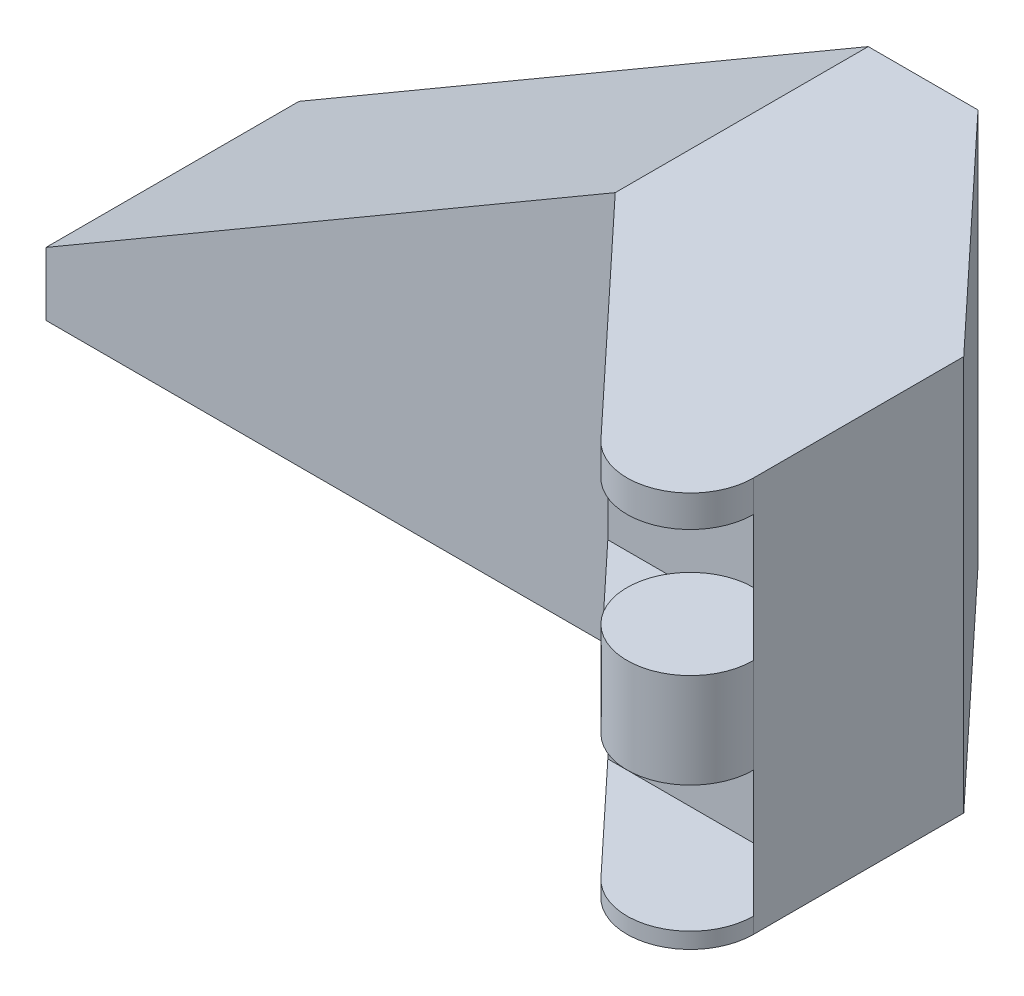
ISO-10303-21;
HEADER;
FILE_DESCRIPTION(('STEP AP214'),'2;1');
FILE_NAME('part.step','',(''),(''),'','','');
FILE_SCHEMA(('AUTOMOTIVE_DESIGN { 1 0 10303 214 1 1 1 1 }'));
ENDSEC;
DATA;
#1=APPLICATION_CONTEXT('core data for automotive mechanical design processes');
#2=APPLICATION_PROTOCOL_DEFINITION('international standard','automotive_design',2000,#1);
#3=PRODUCT_CONTEXT('',#1,'mechanical');
#4=PRODUCT('Part','Part','',(#3));
#5=PRODUCT_RELATED_PRODUCT_CATEGORY('part','',(#4));
#6=PRODUCT_DEFINITION_FORMATION('','',#4);
#7=PRODUCT_DEFINITION_CONTEXT('part definition',#1,'design');
#8=PRODUCT_DEFINITION('design','',#6,#7);
#9=PRODUCT_DEFINITION_SHAPE('','',#8);
#10=(LENGTH_UNIT() NAMED_UNIT(*) SI_UNIT(.MILLI.,.METRE.));
#11=(NAMED_UNIT(*) PLANE_ANGLE_UNIT() SI_UNIT($,.RADIAN.));
#12=(NAMED_UNIT(*) SI_UNIT($,.STERADIAN.) SOLID_ANGLE_UNIT());
#13=UNCERTAINTY_MEASURE_WITH_UNIT(LENGTH_MEASURE(1.E-05),#10,'distance_accuracy_value','');
#14=(GEOMETRIC_REPRESENTATION_CONTEXT(3) GLOBAL_UNCERTAINTY_ASSIGNED_CONTEXT((#13)) GLOBAL_UNIT_ASSIGNED_CONTEXT((#10,
#11,#12)) REPRESENTATION_CONTEXT('',''));
#15=CARTESIAN_POINT('',(0.,0.,0.));
#16=DIRECTION('',(0.,0.,1.));
#17=DIRECTION('',(1.,0.,0.));
#18=AXIS2_PLACEMENT_3D('',#15,#16,#17);
#19=CARTESIAN_POINT('',(8.06251028519232,39.6875,22.1971381499487));
#20=DIRECTION('',(0.730313340914596,0.,-0.683112307078537));
#21=DIRECTION('',(-0.683112307078537,0.,-0.730313340914596));
#22=AXIS2_PLACEMENT_3D('',#19,#20,#21);
#23=PLANE('',#22);
#24=DIRECTION('',(0.,1.,0.));
#25=VECTOR('',#24,1.);
#26=CARTESIAN_POINT('',(-1.93448981578791,1.5875,11.509375));
#27=LINE('',#26,#25);
#28=CARTESIAN_POINT('',(-1.93448981578791,1.5875,11.509375));
#29=VERTEX_POINT('',#28);
#30=CARTESIAN_POINT('',(-1.93448981578791,17.4625,11.509375));
#31=VERTEX_POINT('',#30);
#32=EDGE_CURVE('E270',#29,#31,#27,.T.);
#33=ORIENTED_EDGE('',*,*,#32,.T.);
#34=DIRECTION('',(0.683112307078537,0.,0.730313340914596));
#35=VECTOR('',#34,1.);
#36=CARTESIAN_POINT('',(8.06251028519232,17.4625,22.1971381499487));
#37=LINE('',#36,#35);
#38=CARTESIAN_POINT('',(8.06251028519232,17.4625,22.1971381499487));
#39=VERTEX_POINT('',#38);
#40=EDGE_CURVE('E363',#31,#39,#37,.T.);
#41=ORIENTED_EDGE('',*,*,#40,.T.);
#42=DIRECTION('',(0.,-1.,0.));
#43=VECTOR('',#42,1.);
#44=CARTESIAN_POINT('',(8.06251028519232,39.6875,22.1971381499487));
#45=LINE('',#44,#43);
#46=CARTESIAN_POINT('',(8.06251028519232,20.6375,22.1971381499487));
#47=VERTEX_POINT('',#46);
#48=EDGE_CURVE('E210',#47,#39,#45,.T.);
#49=ORIENTED_EDGE('',*,*,#48,.F.);
#50=DIRECTION('',(0.683112307078537,0.,0.730313340914596));
#51=VECTOR('',#50,1.);
#52=CARTESIAN_POINT('',(-1.93448981578791,20.6375,11.509375));
#53=LINE('',#52,#51);
#54=CARTESIAN_POINT('',(-1.93448981578791,20.6375,11.509375));
#55=VERTEX_POINT('',#54);
#56=EDGE_CURVE('E321',#55,#47,#53,.T.);
#57=ORIENTED_EDGE('',*,*,#56,.F.);
#58=DIRECTION('',(0.,1.,0.));
#59=VECTOR('',#58,1.);
#60=CARTESIAN_POINT('',(-1.93448981578791,23.8125,11.509375));
#61=LINE('',#60,#59);
#62=CARTESIAN_POINT('',(-1.93448981578791,36.5125,11.509375));
#63=VERTEX_POINT('',#62);
#64=EDGE_CURVE('E181',#55,#63,#61,.T.);
#65=ORIENTED_EDGE('',*,*,#64,.T.);
#66=DIRECTION('',(0.683112307078537,0.,0.730313340914596));
#67=VECTOR('',#66,1.);
#68=CARTESIAN_POINT('',(-1.93448981578791,36.5125,11.509375));
#69=LINE('',#68,#67);
#70=CARTESIAN_POINT('',(8.06251028519232,36.5125,22.1971381499487));
#71=VERTEX_POINT('',#70);
#72=EDGE_CURVE('E278',#63,#71,#69,.T.);
#73=ORIENTED_EDGE('',*,*,#72,.T.);
#74=CARTESIAN_POINT('',(8.06251028519232,39.6875,22.1971381499487));
#75=VERTEX_POINT('',#74);
#76=EDGE_CURVE('E206',#75,#71,#45,.T.);
#77=ORIENTED_EDGE('',*,*,#76,.F.);
#78=DIRECTION('',(0.683112307078537,0.,0.730313340914596));
#79=VECTOR('',#78,1.);
#80=CARTESIAN_POINT('',(8.06251028519232,39.6875,22.1971381499487));
#81=LINE('',#80,#79);
#82=CARTESIAN_POINT('',(-12.7,39.6875,0.));
#83=VERTEX_POINT('',#82);
#84=EDGE_CURVE('E194',#83,#75,#81,.T.);
#85=ORIENTED_EDGE('',*,*,#84,.F.);
#86=DIRECTION('',(0.,-1.,0.));
#87=VECTOR('',#86,1.);
#88=CARTESIAN_POINT('',(-12.7,39.6875,0.));
#89=LINE('',#88,#87);
#90=CARTESIAN_POINT('',(-12.7,0.,0.));
#91=VERTEX_POINT('',#90);
#92=EDGE_CURVE('E209',#83,#91,#89,.T.);
#93=ORIENTED_EDGE('',*,*,#92,.T.);
#94=DIRECTION('',(0.683112307078537,0.,0.730313340914596));
#95=VECTOR('',#94,1.);
#96=CARTESIAN_POINT('',(8.06251028519232,0.,22.1971381499487));
#97=LINE('',#96,#95);
#98=CARTESIAN_POINT('',(8.06251028519232,0.,22.1971381499487));
#99=VERTEX_POINT('',#98);
#100=EDGE_CURVE('E183',#91,#99,#97,.T.);
#101=ORIENTED_EDGE('',*,*,#100,.T.);
#102=CARTESIAN_POINT('',(8.06251028519232,1.5875,22.1971381499487));
#103=VERTEX_POINT('',#102);
#104=EDGE_CURVE('E204',#103,#99,#45,.T.);
#105=ORIENTED_EDGE('',*,*,#104,.F.);
#106=DIRECTION('',(0.683112307078537,0.,0.730313340914596));
#107=VECTOR('',#106,1.);
#108=CARTESIAN_POINT('',(-1.93448981578791,1.5875,11.509375));
#109=LINE('',#108,#107);
#110=EDGE_CURVE('E335',#29,#103,#109,.T.);
#111=ORIENTED_EDGE('',*,*,#110,.F.);
#112=EDGE_LOOP('',(#33,#41,#49,#57,#65,#73,#77,#85,#93,#101,#105,#111));
#113=FACE_BOUND('',#112,.T.);
#114=ADVANCED_FACE('F33',(#113),#23,.F.);
#115=CARTESIAN_POINT('',(12.7,39.6875,17.859375));
#116=DIRECTION('',(0.,-1.,0.));
#117=DIRECTION('',(0.,0.,-1.));
#118=AXIS2_PLACEMENT_3D('',#115,#116,#117);
#119=CYLINDRICAL_SURFACE('',#118,6.35);
#120=CARTESIAN_POINT('',(12.7,1.5875,17.859375));
#121=DIRECTION('',(0.,1.,0.));
#122=DIRECTION('',(0.,0.,1.));
#123=AXIS2_PLACEMENT_3D('',#120,#121,#122);
#124=CIRCLE('',#123,6.35);
#125=CARTESIAN_POINT('',(19.05,1.58750000000002,17.859375));
#126=VERTEX_POINT('',#125);
#127=EDGE_CURVE('E48',#103,#126,#124,.T.);
#128=ORIENTED_EDGE('',*,*,#127,.F.);
#129=ORIENTED_EDGE('',*,*,#104,.T.);
#130=CARTESIAN_POINT('',(12.7,0.,17.859375));
#131=DIRECTION('',(0.,1.,0.));
#132=DIRECTION('',(0.,0.,1.));
#133=AXIS2_PLACEMENT_3D('',#130,#131,#132);
#134=CIRCLE('',#133,6.35);
#135=CARTESIAN_POINT('',(19.05,0.,17.859375));
#136=VERTEX_POINT('',#135);
#137=EDGE_CURVE('E186',#99,#136,#134,.T.);
#138=ORIENTED_EDGE('',*,*,#137,.T.);
#139=DIRECTION('',(0.,-1.,0.));
#140=VECTOR('',#139,1.);
#141=CARTESIAN_POINT('',(19.05,39.6875,17.859375));
#142=LINE('',#141,#140);
#143=EDGE_CURVE('E200',#126,#136,#142,.T.);
#144=ORIENTED_EDGE('',*,*,#143,.F.);
#145=EDGE_LOOP('',(#128,#129,#138,#144));
#146=FACE_BOUND('',#145,.T.);
#147=ADVANCED_FACE('F236',(#146),#119,.T.);
#148=CARTESIAN_POINT('',(12.7,23.8125,17.859375));
#149=DIRECTION('',(0.,1.,0.));
#150=DIRECTION('',(0.,0.,1.));
#151=AXIS2_PLACEMENT_3D('',#148,#149,#150);
#152=CIRCLE('',#151,6.35);
#153=CARTESIAN_POINT('',(12.7,23.8125,11.509375));
#154=VERTEX_POINT('',#153);
#155=CARTESIAN_POINT('',(19.05,23.8125,17.859375));
#156=VERTEX_POINT('',#155);
#157=EDGE_CURVE('E55',#154,#156,#152,.T.);
#158=ORIENTED_EDGE('',*,*,#157,.F.);
#159=DIRECTION('',(0.,1.,0.));
#160=VECTOR('',#159,1.);
#161=CARTESIAN_POINT('',(12.7,20.6375,11.509375));
#162=LINE('',#161,#160);
#163=CARTESIAN_POINT('',(12.7,20.6375,11.509375));
#164=VERTEX_POINT('',#163);
#165=EDGE_CURVE('E314',#164,#154,#162,.T.);
#166=ORIENTED_EDGE('',*,*,#165,.F.);
#167=CARTESIAN_POINT('',(12.7,20.6375,17.859375));
#168=DIRECTION('',(0.,-1.,0.));
#169=DIRECTION('',(0.,0.,1.));
#170=AXIS2_PLACEMENT_3D('',#167,#168,#169);
#171=CIRCLE('',#170,6.35);
#172=EDGE_CURVE('E352',#47,#164,#171,.T.);
#173=ORIENTED_EDGE('',*,*,#172,.F.);
#174=ORIENTED_EDGE('',*,*,#48,.T.);
#175=CARTESIAN_POINT('',(12.7,17.4625,17.859375));
#176=DIRECTION('',(0.,1.,0.));
#177=DIRECTION('',(0.,0.,1.));
#178=AXIS2_PLACEMENT_3D('',#175,#176,#177);
#179=CIRCLE('',#178,6.35);
#180=CARTESIAN_POINT('',(12.7,17.4625,11.509375));
#181=VERTEX_POINT('',#180);
#182=EDGE_CURVE('E351',#181,#39,#179,.T.);
#183=ORIENTED_EDGE('',*,*,#182,.F.);
#184=DIRECTION('',(0.,-1.,0.));
#185=VECTOR('',#184,1.);
#186=CARTESIAN_POINT('',(12.7,17.4625,11.509375));
#187=LINE('',#186,#185);
#188=CARTESIAN_POINT('',(12.7,14.2875,11.509375));
#189=VERTEX_POINT('',#188);
#190=EDGE_CURVE('E343',#181,#189,#187,.T.);
#191=ORIENTED_EDGE('',*,*,#190,.T.);
#192=CARTESIAN_POINT('',(12.7,14.2875,17.859375));
#193=DIRECTION('',(0.,1.,0.));
#194=DIRECTION('',(0.,0.,1.));
#195=AXIS2_PLACEMENT_3D('',#192,#193,#194);
#196=CIRCLE('',#195,6.35);
#197=CARTESIAN_POINT('',(19.05,14.2875,17.859375));
#198=VERTEX_POINT('',#197);
#199=EDGE_CURVE('E324',#189,#198,#196,.T.);
#200=ORIENTED_EDGE('',*,*,#199,.T.);
#201=EDGE_CURVE('E257',#156,#198,#142,.T.);
#202=ORIENTED_EDGE('',*,*,#201,.F.);
#203=EDGE_LOOP('',(#158,#166,#173,#174,#183,#191,#200,#202));
#204=FACE_BOUND('',#203,.T.);
#205=ADVANCED_FACE('F300',(#204),#119,.T.);
#206=CARTESIAN_POINT('',(-69.85,39.6875,0.));
#207=DIRECTION('',(1.,0.,0.));
#208=DIRECTION('',(0.,0.,-1.));
#209=AXIS2_PLACEMENT_3D('',#206,#207,#208);
#210=PLANE('',#209);
#211=DIRECTION('',(0.,-1.,0.));
#212=VECTOR('',#211,1.);
#213=CARTESIAN_POINT('',(-69.85,39.6875,0.));
#214=LINE('',#213,#212);
#215=CARTESIAN_POINT('',(-69.85,6.35,0.));
#216=VERTEX_POINT('',#215);
#217=CARTESIAN_POINT('',(-69.85,0.,0.));
#218=VERTEX_POINT('',#217);
#219=EDGE_CURVE('E41',#216,#218,#214,.T.);
#220=ORIENTED_EDGE('',*,*,#219,.F.);
#221=DIRECTION('',(0.,0.,-1.));
#222=VECTOR('',#221,1.);
#223=CARTESIAN_POINT('',(-69.85,6.35,24.209375));
#224=LINE('',#223,#222);
#225=CARTESIAN_POINT('',(-69.85,6.35,-25.4));
#226=VERTEX_POINT('',#225);
#227=EDGE_CURVE('E164',#216,#226,#224,.T.);
#228=ORIENTED_EDGE('',*,*,#227,.T.);
#229=DIRECTION('',(0.,-1.,0.));
#230=VECTOR('',#229,1.);
#231=CARTESIAN_POINT('',(-69.85,39.6875,-25.4));
#232=LINE('',#231,#230);
#233=CARTESIAN_POINT('',(-69.85,0.,-25.4));
#234=VERTEX_POINT('',#233);
#235=EDGE_CURVE('E163',#226,#234,#232,.T.);
#236=ORIENTED_EDGE('',*,*,#235,.T.);
#237=DIRECTION('',(0.,0.,1.));
#238=VECTOR('',#237,1.);
#239=CARTESIAN_POINT('',(-69.85,0.,0.));
#240=LINE('',#239,#238);
#241=EDGE_CURVE('E177',#234,#218,#240,.T.);
#242=ORIENTED_EDGE('',*,*,#241,.T.);
#243=EDGE_LOOP('',(#220,#228,#236,#242));
#244=FACE_BOUND('',#243,.T.);
#245=ADVANCED_FACE('F35',(#244),#210,.F.);
#246=CARTESIAN_POINT('',(-12.7,39.6875,0.));
#247=DIRECTION('',(0.,0.,-1.));
#248=DIRECTION('',(-1.,0.,0.));
#249=AXIS2_PLACEMENT_3D('',#246,#247,#248);
#250=PLANE('',#249);
#251=ORIENTED_EDGE('',*,*,#92,.F.);
#252=DIRECTION('',(-0.863778900898434,-0.503871025524086,0.));
#253=VECTOR('',#252,1.);
#254=CARTESIAN_POINT('',(-12.7,39.6875,0.));
#255=LINE('',#254,#253);
#256=EDGE_CURVE('E152',#83,#216,#255,.T.);
#257=ORIENTED_EDGE('',*,*,#256,.T.);
#258=ORIENTED_EDGE('',*,*,#219,.T.);
#259=DIRECTION('',(1.,0.,0.));
#260=VECTOR('',#259,1.);
#261=CARTESIAN_POINT('',(-12.7,0.,0.));
#262=LINE('',#261,#260);
#263=EDGE_CURVE('E180',#218,#91,#262,.T.);
#264=ORIENTED_EDGE('',*,*,#263,.T.);
#265=EDGE_LOOP('',(#251,#257,#258,#264));
#266=FACE_BOUND('',#265,.T.);
#267=ADVANCED_FACE('F215',(#266),#250,.F.);
#268=ORIENTED_EDGE('',*,*,#76,.T.);
#269=CARTESIAN_POINT('',(12.7,36.5125,17.859375));
#270=DIRECTION('',(0.,1.,0.));
#271=DIRECTION('',(0.,0.,1.));
#272=AXIS2_PLACEMENT_3D('',#269,#270,#271);
#273=CIRCLE('',#272,6.35);
#274=CARTESIAN_POINT('',(19.05,36.5125,17.859375));
#275=VERTEX_POINT('',#274);
#276=EDGE_CURVE('E254',#71,#275,#273,.T.);
#277=ORIENTED_EDGE('',*,*,#276,.T.);
#278=CARTESIAN_POINT('',(19.05,39.6875,17.859375));
#279=VERTEX_POINT('',#278);
#280=EDGE_CURVE('E201',#279,#275,#142,.T.);
#281=ORIENTED_EDGE('',*,*,#280,.F.);
#282=CARTESIAN_POINT('',(12.7,39.6875,17.859375));
#283=DIRECTION('',(0.,1.,0.));
#284=DIRECTION('',(0.,0.,1.));
#285=AXIS2_PLACEMENT_3D('',#282,#283,#284);
#286=CIRCLE('',#285,6.35);
#287=EDGE_CURVE('E244',#75,#279,#286,.T.);
#288=ORIENTED_EDGE('',*,*,#287,.F.);
#289=EDGE_LOOP('',(#268,#277,#281,#288));
#290=FACE_BOUND('',#289,.T.);
#291=ADVANCED_FACE('F253',(#290),#119,.T.);
#292=CARTESIAN_POINT('',(19.05,39.6875,17.859375));
#293=DIRECTION('',(-1.,0.,0.));
#294=DIRECTION('',(0.,0.,1.));
#295=AXIS2_PLACEMENT_3D('',#292,#293,#294);
#296=PLANE('',#295);
#297=DIRECTION('',(0.,0.,-1.));
#298=VECTOR('',#297,1.);
#299=CARTESIAN_POINT('',(19.05,0.,17.859375));
#300=LINE('',#299,#298);
#301=CARTESIAN_POINT('',(19.05,0.,-3.23892777664039));
#302=VERTEX_POINT('',#301);
#303=EDGE_CURVE('E189',#136,#302,#300,.T.);
#304=ORIENTED_EDGE('',*,*,#303,.T.);
#305=DIRECTION('',(0.,-1.,0.));
#306=VECTOR('',#305,1.);
#307=CARTESIAN_POINT('',(19.05,39.6875,-3.23892777664039));
#308=LINE('',#307,#306);
#309=CARTESIAN_POINT('',(19.05,39.6875,-3.23892777664039));
#310=VERTEX_POINT('',#309);
#311=EDGE_CURVE('E197',#310,#302,#308,.T.);
#312=ORIENTED_EDGE('',*,*,#311,.F.);
#313=DIRECTION('',(0.,0.,-1.));
#314=VECTOR('',#313,1.);
#315=CARTESIAN_POINT('',(19.05,39.6875,17.859375));
#316=LINE('',#315,#314);
#317=EDGE_CURVE('E173',#279,#310,#316,.T.);
#318=ORIENTED_EDGE('',*,*,#317,.F.);
#319=ORIENTED_EDGE('',*,*,#280,.T.);
#320=EDGE_CURVE('E205',#275,#156,#142,.T.);
#321=ORIENTED_EDGE('',*,*,#320,.T.);
#322=ORIENTED_EDGE('',*,*,#201,.T.);
#323=EDGE_CURVE('E234',#198,#126,#142,.T.);
#324=ORIENTED_EDGE('',*,*,#323,.T.);
#325=ORIENTED_EDGE('',*,*,#143,.T.);
#326=EDGE_LOOP('',(#304,#312,#318,#319,#321,#322,#324,#325));
#327=FACE_BOUND('',#326,.T.);
#328=ADVANCED_FACE('F230',(#327),#296,.F.);
#329=CARTESIAN_POINT('',(19.05,39.6875,-3.23892777664039));
#330=DIRECTION('',(-0.730313340914596,0.,0.683112307078537));
#331=DIRECTION('',(0.683112307078537,0.,0.730313340914596));
#332=AXIS2_PLACEMENT_3D('',#329,#330,#331);
#333=PLANE('',#332);
#334=DIRECTION('',(-0.683112307078537,0.,-0.730313340914596));
#335=VECTOR('',#334,1.);
#336=CARTESIAN_POINT('',(19.05,0.,-3.23892777664039));
#337=LINE('',#336,#335);
#338=CARTESIAN_POINT('',(-1.67877534302577,0.,-25.4));
#339=VERTEX_POINT('',#338);
#340=EDGE_CURVE('E191',#302,#339,#337,.T.);
#341=ORIENTED_EDGE('',*,*,#340,.T.);
#342=DIRECTION('',(0.,-1.,0.));
#343=VECTOR('',#342,1.);
#344=CARTESIAN_POINT('',(-1.67877534302577,39.6875,-25.4));
#345=LINE('',#344,#343);
#346=CARTESIAN_POINT('',(-1.67877534302577,39.6875,-25.4));
#347=VERTEX_POINT('',#346);
#348=EDGE_CURVE('E171',#347,#339,#345,.T.);
#349=ORIENTED_EDGE('',*,*,#348,.F.);
#350=DIRECTION('',(-0.683112307078537,0.,-0.730313340914596));
#351=VECTOR('',#350,1.);
#352=CARTESIAN_POINT('',(19.05,39.6875,-3.23892777664039));
#353=LINE('',#352,#351);
#354=EDGE_CURVE('E168',#310,#347,#353,.T.);
#355=ORIENTED_EDGE('',*,*,#354,.F.);
#356=ORIENTED_EDGE('',*,*,#311,.T.);
#357=EDGE_LOOP('',(#341,#349,#355,#356));
#358=FACE_BOUND('',#357,.T.);
#359=ADVANCED_FACE('F226',(#358),#333,.F.);
#360=CARTESIAN_POINT('',(-69.85,39.6875,-25.4));
#361=DIRECTION('',(0.,0.,1.));
#362=DIRECTION('',(1.,0.,0.));
#363=AXIS2_PLACEMENT_3D('',#360,#361,#362);
#364=PLANE('',#363);
#365=ORIENTED_EDGE('',*,*,#235,.F.);
#366=DIRECTION('',(-0.863778900898433,-0.503871025524086,0.));
#367=VECTOR('',#366,1.);
#368=CARTESIAN_POINT('',(-69.85,6.35,-25.4));
#369=LINE('',#368,#367);
#370=CARTESIAN_POINT('',(-12.7,39.6875,-25.4));
#371=VERTEX_POINT('',#370);
#372=EDGE_CURVE('E149',#371,#226,#369,.T.);
#373=ORIENTED_EDGE('',*,*,#372,.F.);
#374=DIRECTION('',(-1.,0.,0.));
#375=VECTOR('',#374,1.);
#376=CARTESIAN_POINT('',(-69.85,39.6875,-25.4));
#377=LINE('',#376,#375);
#378=EDGE_CURVE('E161',#347,#371,#377,.T.);
#379=ORIENTED_EDGE('',*,*,#378,.F.);
#380=ORIENTED_EDGE('',*,*,#348,.T.);
#381=DIRECTION('',(-1.,0.,0.));
#382=VECTOR('',#381,1.);
#383=CARTESIAN_POINT('',(-69.85,0.,-25.4));
#384=LINE('',#383,#382);
#385=EDGE_CURVE('E193',#339,#234,#384,.T.);
#386=ORIENTED_EDGE('',*,*,#385,.T.);
#387=EDGE_LOOP('',(#365,#373,#379,#380,#386));
#388=FACE_BOUND('',#387,.T.);
#389=ADVANCED_FACE('F159',(#388),#364,.F.);
#390=CARTESIAN_POINT('',(12.7,39.6875,17.859375));
#391=DIRECTION('',(0.,1.,0.));
#392=DIRECTION('',(0.,0.,1.));
#393=AXIS2_PLACEMENT_3D('',#390,#391,#392);
#394=PLANE('',#393);
#395=DIRECTION('',(0.,0.,-1.));
#396=VECTOR('',#395,1.);
#397=CARTESIAN_POINT('',(-12.7,39.6875,17.859375));
#398=LINE('',#397,#396);
#399=EDGE_CURVE('E11',#83,#371,#398,.T.);
#400=ORIENTED_EDGE('',*,*,#399,.F.);
#401=ORIENTED_EDGE('',*,*,#84,.T.);
#402=ORIENTED_EDGE('',*,*,#287,.T.);
#403=ORIENTED_EDGE('',*,*,#317,.T.);
#404=ORIENTED_EDGE('',*,*,#354,.T.);
#405=ORIENTED_EDGE('',*,*,#378,.T.);
#406=EDGE_LOOP('',(#400,#401,#402,#403,#404,#405));
#407=FACE_BOUND('',#406,.T.);
#408=ADVANCED_FACE('F166',(#407),#394,.T.);
#409=CARTESIAN_POINT('',(12.7,0.,17.859375));
#410=DIRECTION('',(0.,1.,0.));
#411=DIRECTION('',(0.,0.,1.));
#412=AXIS2_PLACEMENT_3D('',#409,#410,#411);
#413=PLANE('',#412);
#414=ORIENTED_EDGE('',*,*,#241,.F.);
#415=ORIENTED_EDGE('',*,*,#385,.F.);
#416=ORIENTED_EDGE('',*,*,#340,.F.);
#417=ORIENTED_EDGE('',*,*,#303,.F.);
#418=ORIENTED_EDGE('',*,*,#137,.F.);
#419=ORIENTED_EDGE('',*,*,#100,.F.);
#420=ORIENTED_EDGE('',*,*,#263,.F.);
#421=EDGE_LOOP('',(#414,#415,#416,#417,#418,#419,#420));
#422=FACE_BOUND('',#421,.T.);
#423=ADVANCED_FACE('F220',(#422),#413,.F.);
#424=CARTESIAN_POINT('',(12.7,23.8125,17.859375));
#425=DIRECTION('',(0.,1.,0.));
#426=DIRECTION('',(0.,0.,1.));
#427=AXIS2_PLACEMENT_3D('',#424,#425,#426);
#428=CYLINDRICAL_SURFACE('',#427,6.35);
#429=ORIENTED_EDGE('',*,*,#320,.F.);
#430=CARTESIAN_POINT('',(12.7,36.5125,11.509375));
#431=VERTEX_POINT('',#430);
#432=EDGE_CURVE('E262',#275,#431,#273,.T.);
#433=ORIENTED_EDGE('',*,*,#432,.T.);
#434=DIRECTION('',(0.,1.,0.));
#435=VECTOR('',#434,1.);
#436=CARTESIAN_POINT('',(12.7,23.8125,11.509375));
#437=LINE('',#436,#435);
#438=EDGE_CURVE('E248',#154,#431,#437,.T.);
#439=ORIENTED_EDGE('',*,*,#438,.F.);
#440=EDGE_CURVE('E264',#156,#154,#152,.T.);
#441=ORIENTED_EDGE('',*,*,#440,.F.);
#442=EDGE_LOOP('',(#429,#433,#439,#441));
#443=FACE_BOUND('',#442,.T.);
#444=ADVANCED_FACE('F260',(#443),#428,.F.);
#445=CARTESIAN_POINT('',(12.7,23.8125,11.509375));
#446=DIRECTION('',(0.,0.,-1.));
#447=DIRECTION('',(-1.,0.,0.));
#448=AXIS2_PLACEMENT_3D('',#445,#446,#447);
#449=PLANE('',#448);
#450=DIRECTION('',(-1.,0.,0.));
#451=VECTOR('',#450,1.);
#452=CARTESIAN_POINT('',(12.7,36.5125,11.509375));
#453=LINE('',#452,#451);
#454=EDGE_CURVE('E269',#431,#63,#453,.T.);
#455=ORIENTED_EDGE('',*,*,#454,.T.);
#456=ORIENTED_EDGE('',*,*,#64,.F.);
#457=DIRECTION('',(-1.,0.,0.));
#458=VECTOR('',#457,1.);
#459=CARTESIAN_POINT('',(12.7,20.6375,11.509375));
#460=LINE('',#459,#458);
#461=EDGE_CURVE('E318',#164,#55,#460,.T.);
#462=ORIENTED_EDGE('',*,*,#461,.F.);
#463=ORIENTED_EDGE('',*,*,#165,.T.);
#464=ORIENTED_EDGE('',*,*,#438,.T.);
#465=EDGE_LOOP('',(#455,#456,#462,#463,#464));
#466=FACE_BOUND('',#465,.T.);
#467=ADVANCED_FACE('F285',(#466),#449,.F.);
#468=CARTESIAN_POINT('',(12.7,23.8125,17.859375));
#469=DIRECTION('',(0.,1.,0.));
#470=DIRECTION('',(0.,0.,1.));
#471=AXIS2_PLACEMENT_3D('',#468,#469,#470);
#472=PLANE('',#471);
#473=ORIENTED_EDGE('',*,*,#440,.T.);
#474=ORIENTED_EDGE('',*,*,#157,.T.);
#475=EDGE_LOOP('',(#473,#474));
#476=FACE_BOUND('',#475,.T.);
#477=ADVANCED_FACE('F283',(#476),#472,.T.);
#478=CARTESIAN_POINT('',(12.7,36.5125,17.859375));
#479=DIRECTION('',(0.,1.,0.));
#480=DIRECTION('',(0.,0.,1.));
#481=AXIS2_PLACEMENT_3D('',#478,#479,#480);
#482=PLANE('',#481);
#483=ORIENTED_EDGE('',*,*,#276,.F.);
#484=ORIENTED_EDGE('',*,*,#72,.F.);
#485=ORIENTED_EDGE('',*,*,#454,.F.);
#486=ORIENTED_EDGE('',*,*,#432,.F.);
#487=EDGE_LOOP('',(#483,#484,#485,#486));
#488=FACE_BOUND('',#487,.T.);
#489=ADVANCED_FACE('F267',(#488),#482,.F.);
#490=CARTESIAN_POINT('',(12.7,1.5875,17.859375));
#491=DIRECTION('',(0.,1.,0.));
#492=DIRECTION('',(0.,0.,1.));
#493=AXIS2_PLACEMENT_3D('',#490,#491,#492);
#494=CYLINDRICAL_SURFACE('',#493,6.35);
#495=ORIENTED_EDGE('',*,*,#323,.F.);
#496=EDGE_CURVE('E320',#198,#189,#196,.T.);
#497=ORIENTED_EDGE('',*,*,#496,.T.);
#498=DIRECTION('',(0.,1.,0.));
#499=VECTOR('',#498,1.);
#500=CARTESIAN_POINT('',(12.7,1.5875,11.509375));
#501=LINE('',#500,#499);
#502=CARTESIAN_POINT('',(12.7,1.5875,11.509375));
#503=VERTEX_POINT('',#502);
#504=EDGE_CURVE('E272',#503,#189,#501,.T.);
#505=ORIENTED_EDGE('',*,*,#504,.F.);
#506=EDGE_CURVE('E332',#126,#503,#124,.T.);
#507=ORIENTED_EDGE('',*,*,#506,.F.);
#508=EDGE_LOOP('',(#495,#497,#505,#507));
#509=FACE_BOUND('',#508,.T.);
#510=ADVANCED_FACE('F291',(#509),#494,.F.);
#511=CARTESIAN_POINT('',(12.7,1.5875,11.509375));
#512=DIRECTION('',(0.,0.,-1.));
#513=DIRECTION('',(-1.,0.,0.));
#514=AXIS2_PLACEMENT_3D('',#511,#512,#513);
#515=PLANE('',#514);
#516=ORIENTED_EDGE('',*,*,#504,.T.);
#517=ORIENTED_EDGE('',*,*,#190,.F.);
#518=DIRECTION('',(-1.,0.,0.));
#519=VECTOR('',#518,1.);
#520=CARTESIAN_POINT('',(12.7,17.4625,11.509375));
#521=LINE('',#520,#519);
#522=EDGE_CURVE('E353',#181,#31,#521,.T.);
#523=ORIENTED_EDGE('',*,*,#522,.T.);
#524=ORIENTED_EDGE('',*,*,#32,.F.);
#525=DIRECTION('',(-1.,0.,0.));
#526=VECTOR('',#525,1.);
#527=CARTESIAN_POINT('',(12.7,1.5875,11.509375));
#528=LINE('',#527,#526);
#529=EDGE_CURVE('E331',#503,#29,#528,.T.);
#530=ORIENTED_EDGE('',*,*,#529,.F.);
#531=EDGE_LOOP('',(#516,#517,#523,#524,#530));
#532=FACE_BOUND('',#531,.T.);
#533=ADVANCED_FACE('F340',(#532),#515,.F.);
#534=CARTESIAN_POINT('',(12.7,1.5875,17.859375));
#535=DIRECTION('',(0.,1.,0.));
#536=DIRECTION('',(0.,0.,1.));
#537=AXIS2_PLACEMENT_3D('',#534,#535,#536);
#538=PLANE('',#537);
#539=ORIENTED_EDGE('',*,*,#127,.T.);
#540=ORIENTED_EDGE('',*,*,#506,.T.);
#541=ORIENTED_EDGE('',*,*,#529,.T.);
#542=ORIENTED_EDGE('',*,*,#110,.T.);
#543=EDGE_LOOP('',(#539,#540,#541,#542));
#544=FACE_BOUND('',#543,.T.);
#545=ADVANCED_FACE('F369',(#544),#538,.T.);
#546=CARTESIAN_POINT('',(12.7,14.2875,17.859375));
#547=DIRECTION('',(0.,1.,0.));
#548=DIRECTION('',(0.,0.,1.));
#549=AXIS2_PLACEMENT_3D('',#546,#547,#548);
#550=PLANE('',#549);
#551=ORIENTED_EDGE('',*,*,#199,.F.);
#552=ORIENTED_EDGE('',*,*,#496,.F.);
#553=EDGE_LOOP('',(#551,#552));
#554=FACE_BOUND('',#553,.T.);
#555=ADVANCED_FACE('F348',(#554),#550,.F.);
#556=CARTESIAN_POINT('',(12.7,20.6375,17.859375));
#557=DIRECTION('',(0.,1.,0.));
#558=DIRECTION('',(0.,0.,1.));
#559=AXIS2_PLACEMENT_3D('',#556,#557,#558);
#560=PLANE('',#559);
#561=ORIENTED_EDGE('',*,*,#172,.T.);
#562=ORIENTED_EDGE('',*,*,#461,.T.);
#563=ORIENTED_EDGE('',*,*,#56,.T.);
#564=EDGE_LOOP('',(#561,#562,#563));
#565=FACE_BOUND('',#564,.T.);
#566=ADVANCED_FACE('F359',(#565),#560,.T.);
#567=CARTESIAN_POINT('',(12.7,17.4625,17.859375));
#568=DIRECTION('',(0.,1.,0.));
#569=DIRECTION('',(0.,0.,1.));
#570=AXIS2_PLACEMENT_3D('',#567,#568,#569);
#571=PLANE('',#570);
#572=ORIENTED_EDGE('',*,*,#40,.F.);
#573=ORIENTED_EDGE('',*,*,#522,.F.);
#574=ORIENTED_EDGE('',*,*,#182,.T.);
#575=EDGE_LOOP('',(#572,#573,#574));
#576=FACE_BOUND('',#575,.T.);
#577=ADVANCED_FACE('F368',(#576),#571,.F.);
#578=CARTESIAN_POINT('',(-69.85,6.35,24.209375));
#579=DIRECTION('',(0.503871025524086,-0.863778900898433,0.));
#580=DIRECTION('',(0.863778900898433,0.503871025524086,0.));
#581=AXIS2_PLACEMENT_3D('',#578,#579,#580);
#582=PLANE('',#581);
#583=ORIENTED_EDGE('',*,*,#399,.T.);
#584=ORIENTED_EDGE('',*,*,#372,.T.);
#585=ORIENTED_EDGE('',*,*,#227,.F.);
#586=ORIENTED_EDGE('',*,*,#256,.F.);
#587=EDGE_LOOP('',(#583,#584,#585,#586));
#588=FACE_BOUND('',#587,.T.);
#589=ADVANCED_FACE('F148',(#588),#582,.F.);
#590=CLOSED_SHELL('',(#114,#147,#205,#245,#267,#291,#328,#359,#389,#408,#423,#444,#467,#477,
#489,#510,#533,#545,#555,#566,#577,#589));
#591=MANIFOLD_SOLID_BREP('B2',#590);
#592=ADVANCED_BREP_SHAPE_REPRESENTATION('',(#18,#591),#14);
#593=SHAPE_DEFINITION_REPRESENTATION(#9,#592);
ENDSEC;
END-ISO-10303-21;
